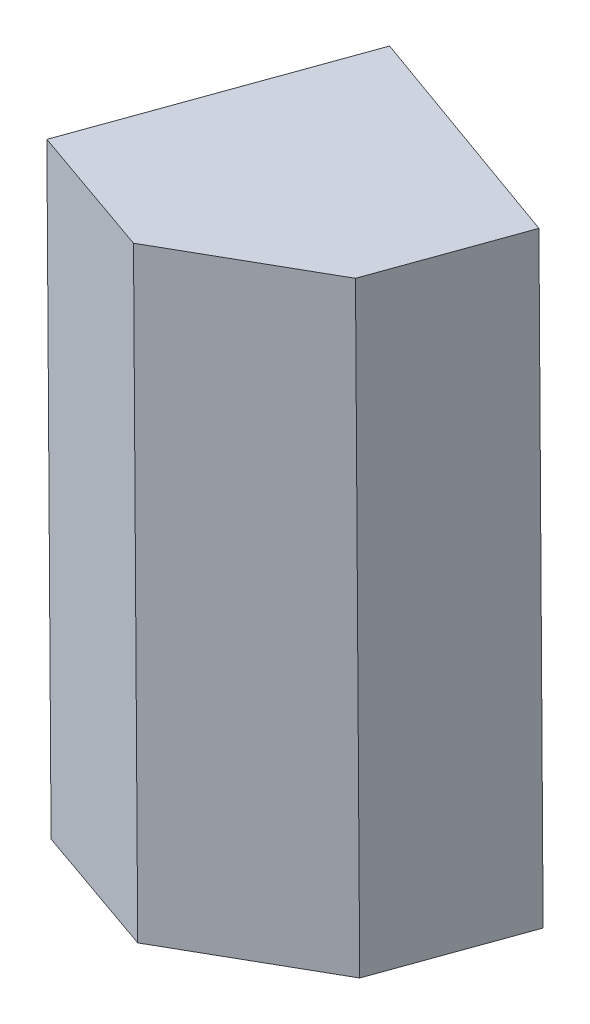
ISO-10303-21;
HEADER;
FILE_DESCRIPTION(('STEP AP214'),'2;1');
FILE_NAME('part.step','',(''),(''),'','','');
FILE_SCHEMA(('AUTOMOTIVE_DESIGN { 1 0 10303 214 1 1 1 1 }'));
ENDSEC;
DATA;
#1=APPLICATION_CONTEXT('core data for automotive mechanical design processes');
#2=APPLICATION_PROTOCOL_DEFINITION('international standard','automotive_design',2000,#1);
#3=PRODUCT_CONTEXT('',#1,'mechanical');
#4=PRODUCT('Part','Part','',(#3));
#5=PRODUCT_RELATED_PRODUCT_CATEGORY('part','',(#4));
#6=PRODUCT_DEFINITION_FORMATION('','',#4);
#7=PRODUCT_DEFINITION_CONTEXT('part definition',#1,'design');
#8=PRODUCT_DEFINITION('design','',#6,#7);
#9=PRODUCT_DEFINITION_SHAPE('','',#8);
#10=(LENGTH_UNIT() NAMED_UNIT(*) SI_UNIT(.MILLI.,.METRE.));
#11=(NAMED_UNIT(*) PLANE_ANGLE_UNIT() SI_UNIT($,.RADIAN.));
#12=(NAMED_UNIT(*) SI_UNIT($,.STERADIAN.) SOLID_ANGLE_UNIT());
#13=UNCERTAINTY_MEASURE_WITH_UNIT(LENGTH_MEASURE(1.E-05),#10,'distance_accuracy_value','');
#14=(GEOMETRIC_REPRESENTATION_CONTEXT(3) GLOBAL_UNCERTAINTY_ASSIGNED_CONTEXT((#13)) GLOBAL_UNIT_ASSIGNED_CONTEXT((#10,
#11,#12)) REPRESENTATION_CONTEXT('',''));
#15=CARTESIAN_POINT('',(0.,0.,0.));
#16=DIRECTION('',(0.,0.,1.));
#17=DIRECTION('',(1.,0.,0.));
#18=AXIS2_PLACEMENT_3D('',#15,#16,#17);
#19=CARTESIAN_POINT('',(214.81394545845,122.223187642647,-184.817100087384));
#20=DIRECTION('',(0.340643141651889,0.00245823248087617,-0.940189452790554));
#21=DIRECTION('',(0.00451831804019345,-0.99998931455239,-0.000977539323207683));
#22=AXIS2_PLACEMENT_3D('',#19,#20,#21);
#23=PLANE('',#22);
#24=DIRECTION('',(0.940167677385507,0.006400210092126,0.340651986212202));
#25=VECTOR('',#24,1.);
#26=CARTESIAN_POINT('',(217.042822791711,112.538136106102,-184.03487086057));
#27=LINE('',#26,#25);
#28=CARTESIAN_POINT('',(215.162487436405,112.525335685828,-184.716174833086));
#29=VERTEX_POINT('',#28);
#30=CARTESIAN_POINT('',(218.923158147017,112.550936526375,-183.353566888054));
#31=VERTEX_POINT('',#30);
#32=EDGE_CURVE('E102',#29,#31,#27,.T.);
#33=ORIENTED_EDGE('',*,*,#32,.F.);
#34=DIRECTION('',(0.00685481188775282,-0.999976496925139,-0.000130963017717442));
#35=VECTOR('',#34,1.);
#36=CARTESIAN_POINT('',(215.129241598357,117.375221696143,-184.715539661844));
#37=LINE('',#36,#35);
#38=CARTESIAN_POINT('',(215.095995761309,122.225107706446,-184.714904491602));
#39=VERTEX_POINT('',#38);
#40=EDGE_CURVE('E36',#39,#29,#37,.T.);
#41=ORIENTED_EDGE('',*,*,#40,.F.);
#42=DIRECTION('',(0.940167677385507,0.006400210092126,0.340651986212202));
#43=VECTOR('',#42,1.);
#44=CARTESIAN_POINT('',(216.976331116598,122.23790812572,-184.033600519091));
#45=LINE('',#44,#43);
#46=CARTESIAN_POINT('',(218.856666471905,122.250708545994,-183.352296546575));
#47=VERTEX_POINT('',#46);
#48=EDGE_CURVE('E11',#39,#47,#45,.T.);
#49=ORIENTED_EDGE('',*,*,#48,.T.);
#50=DIRECTION('',(0.00685481188775282,-0.999976496925139,-0.000130963017717442));
#51=VECTOR('',#50,1.);
#52=CARTESIAN_POINT('',(218.88991230897,117.40082253669,-183.352931716812));
#53=LINE('',#52,#51);
#54=EDGE_CURVE('E27',#47,#31,#53,.T.);
#55=ORIENTED_EDGE('',*,*,#54,.T.);
#56=EDGE_LOOP('',(#33,#41,#49,#55));
#57=FACE_BOUND('',#56,.T.);
#58=ADVANCED_FACE('F17',(#57),#23,.T.);
#59=CARTESIAN_POINT('',(214.880437133563,112.523415623029,-184.818370428863));
#60=DIRECTION('',(-0.00685481191145632,0.999976496924977,0.000130963009120012));
#61=DIRECTION('',(0.940167677384816,0.00640021020914735,0.340651986211909));
#62=AXIS2_PLACEMENT_3D('',#59,#60,#61);
#63=PLANE('',#62);
#64=ORIENTED_EDGE('',*,*,#32,.T.);
#65=DIRECTION('',(-0.340643141651889,-0.00245823248087617,0.940189452790554));
#66=VECTOR('',#65,1.);
#67=CARTESIAN_POINT('',(218.531418534493,112.548109559008,-182.272349016662));
#68=LINE('',#67,#66);
#69=CARTESIAN_POINT('',(218.139678920984,112.545282592663,-181.191131146264));
#70=VERTEX_POINT('',#69);
#71=EDGE_CURVE('E100',#31,#70,#68,.T.);
#72=ORIENTED_EDGE('',*,*,#71,.T.);
#73=DIRECTION('',(-0.872830542630533,-0.00604713943357283,0.487985938276873));
#74=VECTOR('',#73,1.);
#75=CARTESIAN_POINT('',(216.996203897634,112.537360375001,-180.551832100713));
#76=LINE('',#75,#74);
#77=CARTESIAN_POINT('',(215.852728874301,112.529438158338,-179.912533055157));
#78=VERTEX_POINT('',#77);
#79=EDGE_CURVE('E84',#70,#78,#76,.T.);
#80=ORIENTED_EDGE('',*,*,#79,.T.);
#81=DIRECTION('',(-0.942619168432214,-0.00641791141820478,-0.333808198996354));
#82=VECTOR('',#81,1.);
#83=CARTESIAN_POINT('',(214.775598211756,112.522104412398,-180.293975592119));
#84=LINE('',#83,#82);
#85=CARTESIAN_POINT('',(213.698467547211,112.514770666492,-180.675418129078));
#86=VERTEX_POINT('',#85);
#87=EDGE_CURVE('E96',#78,#86,#84,.T.);
#88=ORIENTED_EDGE('',*,*,#87,.T.);
#89=DIRECTION('',(0.340643141651889,0.00245823248087617,-0.940189452790554));
#90=VECTOR('',#89,1.);
#91=CARTESIAN_POINT('',(214.430477493309,112.520053176132,-182.695796480584));
#92=LINE('',#91,#90);
#93=EDGE_CURVE('E91',#86,#29,#92,.T.);
#94=ORIENTED_EDGE('',*,*,#93,.T.);
#95=EDGE_LOOP('',(#64,#72,#80,#88,#94));
#96=FACE_BOUND('',#95,.T.);
#97=ADVANCED_FACE('F106',(#96),#63,.F.);
#98=CARTESIAN_POINT('',(213.529037310209,122.213799837005,-180.390033008033));
#99=DIRECTION('',(-0.940167677384816,-0.0064002102091658,-0.340651986211909));
#100=DIRECTION('',(-0.00623833042053778,0.999979308134339,-0.00157052116615898));
#101=AXIS2_PLACEMENT_3D('',#98,#99,#100);
#102=PLANE('',#101);
#103=ORIENTED_EDGE('',*,*,#93,.F.);
#104=DIRECTION('',(0.00685481195720783,-0.999976496924647,-0.000130963135336369));
#105=VECTOR('',#104,1.);
#106=CARTESIAN_POINT('',(213.665221710164,117.36465667679,-180.674782957837));
#107=LINE('',#106,#105);
#108=CARTESIAN_POINT('',(213.631975873115,122.214542687093,-180.674147787596));
#109=VERTEX_POINT('',#108);
#110=EDGE_CURVE('E88',#109,#86,#107,.T.);
#111=ORIENTED_EDGE('',*,*,#110,.F.);
#112=DIRECTION('',(0.340643141651397,0.00245823256174841,-0.940189452790521));
#113=VECTOR('',#112,1.);
#114=CARTESIAN_POINT('',(214.363985817212,122.219825196767,-182.694526139099));
#115=LINE('',#114,#113);
#116=EDGE_CURVE('E89',#109,#39,#115,.T.);
#117=ORIENTED_EDGE('',*,*,#116,.T.);
#118=ORIENTED_EDGE('',*,*,#40,.T.);
#119=EDGE_LOOP('',(#103,#111,#117,#118));
#120=FACE_BOUND('',#119,.T.);
#121=ADVANCED_FACE('F108',(#120),#102,.T.);
#122=CARTESIAN_POINT('',(214.81394545845,122.223187642647,-184.817100087384));
#123=DIRECTION('',(-0.00685481191145632,0.999976496924977,0.000130963009120012));
#124=DIRECTION('',(0.940167677384816,0.00640021020914735,0.340651986211909));
#125=AXIS2_PLACEMENT_3D('',#122,#123,#124);
#126=PLANE('',#125);
#127=ORIENTED_EDGE('',*,*,#48,.F.);
#128=ORIENTED_EDGE('',*,*,#116,.F.);
#129=DIRECTION('',(-0.942619168432214,-0.00641791141820478,-0.333808198996354));
#130=VECTOR('',#129,1.);
#131=CARTESIAN_POINT('',(214.709106536659,122.221876433021,-180.292705251635));
#132=LINE('',#131,#130);
#133=CARTESIAN_POINT('',(215.786237199187,122.229210177961,-179.911262714678));
#134=VERTEX_POINT('',#133);
#135=EDGE_CURVE('E62',#134,#109,#132,.T.);
#136=ORIENTED_EDGE('',*,*,#135,.F.);
#137=DIRECTION('',(-0.872830542630533,-0.00604713943357283,0.487985938276873));
#138=VECTOR('',#137,1.);
#139=CARTESIAN_POINT('',(216.929712222538,122.237132395619,-180.550561759229));
#140=LINE('',#139,#138);
#141=CARTESIAN_POINT('',(218.073187244854,122.245054611299,-181.189860804788));
#142=VERTEX_POINT('',#141);
#143=EDGE_CURVE('E65',#142,#134,#140,.T.);
#144=ORIENTED_EDGE('',*,*,#143,.F.);
#145=DIRECTION('',(-0.340643141651889,-0.00245823248087617,0.940189452790554));
#146=VECTOR('',#145,1.);
#147=CARTESIAN_POINT('',(218.464926858397,122.247881579643,-182.271078675177));
#148=LINE('',#147,#146);
#149=EDGE_CURVE('E69',#47,#142,#148,.T.);
#150=ORIENTED_EDGE('',*,*,#149,.F.);
#151=EDGE_LOOP('',(#127,#128,#136,#144,#150));
#152=FACE_BOUND('',#151,.T.);
#153=ADVANCED_FACE('F68',(#152),#126,.T.);
#154=CARTESIAN_POINT('',(218.856666470922,122.25070854701,-183.352296546569));
#155=DIRECTION('',(0.940167677384816,0.0064002102091658,0.340651986211909));
#156=DIRECTION('',(0.00623833042053778,-0.999979308134339,0.00157052116615898));
#157=AXIS2_PLACEMENT_3D('',#154,#155,#156);
#158=PLANE('',#157);
#159=ORIENTED_EDGE('',*,*,#71,.F.);
#160=ORIENTED_EDGE('',*,*,#54,.F.);
#161=ORIENTED_EDGE('',*,*,#149,.T.);
#162=DIRECTION('',(0.00685481195720782,-0.999976496924647,-0.000130963135346369));
#163=VECTOR('',#162,1.);
#164=CARTESIAN_POINT('',(218.10643308292,117.395168601978,-181.190495975026));
#165=LINE('',#164,#163);
#166=EDGE_CURVE('E74',#142,#70,#165,.T.);
#167=ORIENTED_EDGE('',*,*,#166,.T.);
#168=EDGE_LOOP('',(#159,#160,#161,#167));
#169=FACE_BOUND('',#168,.T.);
#170=ADVANCED_FACE('F79',(#169),#158,.T.);
#171=CARTESIAN_POINT('',(218.073187244872,122.245054612298,-181.189860804784));
#172=DIRECTION('',(0.487975261509048,0.00323074331113135,0.872851480180239));
#173=DIRECTION('',(-0.872847156704129,-0.00305245892821399,0.487984142701388));
#174=AXIS2_PLACEMENT_3D('',#171,#172,#173);
#175=PLANE('',#174);
#176=ORIENTED_EDGE('',*,*,#79,.F.);
#177=ORIENTED_EDGE('',*,*,#166,.F.);
#178=ORIENTED_EDGE('',*,*,#143,.T.);
#179=DIRECTION('',(0.00685481177694423,-0.999976496925909,-0.000130962933866409));
#180=VECTOR('',#179,1.);
#181=CARTESIAN_POINT('',(215.819483036235,117.379324167658,-179.911897884919));
#182=LINE('',#181,#180);
#183=EDGE_CURVE('E21',#134,#78,#182,.T.);
#184=ORIENTED_EDGE('',*,*,#183,.T.);
#185=EDGE_LOOP('',(#176,#177,#178,#184));
#186=FACE_BOUND('',#185,.T.);
#187=ADVANCED_FACE('F82',(#186),#175,.T.);
#188=CARTESIAN_POINT('',(215.537877038561,122.227519194752,-179.99921409558));
#189=DIRECTION('',(-0.333799512957054,-0.00241164066131641,0.94264100756277));
#190=DIRECTION('',(-0.942633351967262,-0.00391968583715381,-0.333806830100735));
#191=AXIS2_PLACEMENT_3D('',#188,#189,#190);
#192=PLANE('',#191);
#193=ORIENTED_EDGE('',*,*,#87,.F.);
#194=ORIENTED_EDGE('',*,*,#183,.F.);
#195=ORIENTED_EDGE('',*,*,#135,.T.);
#196=ORIENTED_EDGE('',*,*,#110,.T.);
#197=EDGE_LOOP('',(#193,#194,#195,#196));
#198=FACE_BOUND('',#197,.T.);
#199=ADVANCED_FACE('F19',(#198),#192,.T.);
#200=CLOSED_SHELL('',(#58,#97,#121,#153,#170,#187,#199));
#201=MANIFOLD_SOLID_BREP('B1',#200);
#202=ADVANCED_BREP_SHAPE_REPRESENTATION('',(#18,#201),#14);
#203=SHAPE_DEFINITION_REPRESENTATION(#9,#202);
ENDSEC;
END-ISO-10303-21;
